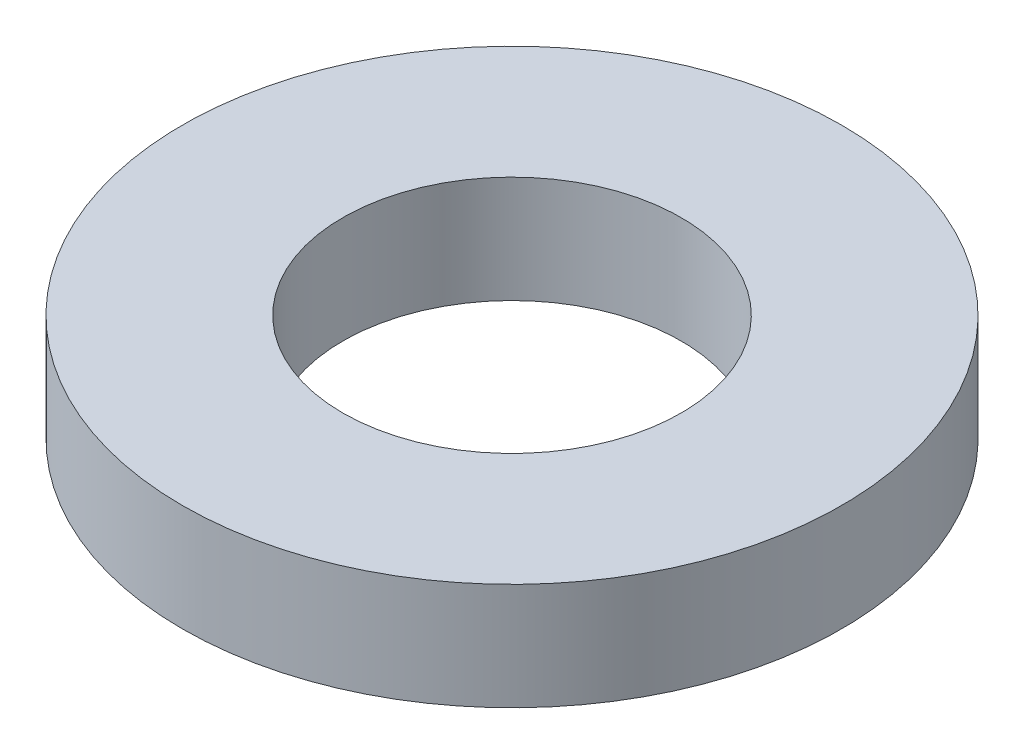
ISO-10303-21;
HEADER;
FILE_DESCRIPTION(('STEP AP214'),'2;1');
FILE_NAME('part.step','',(''),(''),'','','');
FILE_SCHEMA(('AUTOMOTIVE_DESIGN { 1 0 10303 214 1 1 1 1 }'));
ENDSEC;
DATA;
#1=APPLICATION_CONTEXT('core data for automotive mechanical design processes');
#2=APPLICATION_PROTOCOL_DEFINITION('international standard','automotive_design',2000,#1);
#3=PRODUCT_CONTEXT('',#1,'mechanical');
#4=PRODUCT('Part','Part','',(#3));
#5=PRODUCT_RELATED_PRODUCT_CATEGORY('part','',(#4));
#6=PRODUCT_DEFINITION_FORMATION('','',#4);
#7=PRODUCT_DEFINITION_CONTEXT('part definition',#1,'design');
#8=PRODUCT_DEFINITION('design','',#6,#7);
#9=PRODUCT_DEFINITION_SHAPE('','',#8);
#10=(LENGTH_UNIT() NAMED_UNIT(*) SI_UNIT(.MILLI.,.METRE.));
#11=(NAMED_UNIT(*) PLANE_ANGLE_UNIT() SI_UNIT($,.RADIAN.));
#12=(NAMED_UNIT(*) SI_UNIT($,.STERADIAN.) SOLID_ANGLE_UNIT());
#13=UNCERTAINTY_MEASURE_WITH_UNIT(LENGTH_MEASURE(1.E-05),#10,'distance_accuracy_value','');
#14=(GEOMETRIC_REPRESENTATION_CONTEXT(3) GLOBAL_UNCERTAINTY_ASSIGNED_CONTEXT((#13)) GLOBAL_UNIT_ASSIGNED_CONTEXT((#10,
#11,#12)) REPRESENTATION_CONTEXT('',''));
#15=CARTESIAN_POINT('',(0.,0.,0.));
#16=DIRECTION('',(0.,0.,1.));
#17=DIRECTION('',(1.,0.,0.));
#18=AXIS2_PLACEMENT_3D('',#15,#16,#17);
#19=CARTESIAN_POINT('',(0.,30.,0.));
#20=DIRECTION('',(0.,-1.,0.));
#21=DIRECTION('',(0.,0.,-1.));
#22=AXIS2_PLACEMENT_3D('',#19,#20,#21);
#23=CYLINDRICAL_SURFACE('',#22,92.5);
#24=CARTESIAN_POINT('',(0.,30.,0.));
#25=DIRECTION('',(0.,1.,0.));
#26=DIRECTION('',(0.,0.,1.));
#27=AXIS2_PLACEMENT_3D('',#24,#25,#26);
#28=CIRCLE('',#27,92.5);
#29=CARTESIAN_POINT('',(0.,30.,92.5));
#30=VERTEX_POINT('',#29);
#31=EDGE_CURVE('E10',#30,#30,#28,.T.);
#32=ORIENTED_EDGE('',*,*,#31,.F.);
#33=EDGE_LOOP('',(#32));
#34=FACE_BOUND('',#33,.T.);
#35=CARTESIAN_POINT('',(0.,0.,0.));
#36=DIRECTION('',(0.,1.,0.));
#37=DIRECTION('',(0.,0.,1.));
#38=AXIS2_PLACEMENT_3D('',#35,#36,#37);
#39=CIRCLE('',#38,92.5);
#40=CARTESIAN_POINT('',(0.,0.,92.5));
#41=VERTEX_POINT('',#40);
#42=EDGE_CURVE('E37',#41,#41,#39,.T.);
#43=ORIENTED_EDGE('',*,*,#42,.T.);
#44=EDGE_LOOP('',(#43));
#45=FACE_BOUND('',#44,.T.);
#46=ADVANCED_FACE('F40',(#34,#45),#23,.T.);
#47=CARTESIAN_POINT('',(0.,30.,0.));
#48=DIRECTION('',(0.,1.,0.));
#49=DIRECTION('',(0.,0.,1.));
#50=AXIS2_PLACEMENT_3D('',#47,#48,#49);
#51=PLANE('',#50);
#52=CARTESIAN_POINT('',(0.,30.,0.));
#53=DIRECTION('',(0.,1.,0.));
#54=DIRECTION('',(0.,0.,1.));
#55=AXIS2_PLACEMENT_3D('',#52,#53,#54);
#56=CIRCLE('',#55,47.5);
#57=CARTESIAN_POINT('',(0.,30.,47.5));
#58=VERTEX_POINT('',#57);
#59=EDGE_CURVE('E50',#58,#58,#56,.T.);
#60=ORIENTED_EDGE('',*,*,#59,.F.);
#61=EDGE_LOOP('',(#60));
#62=FACE_BOUND('',#61,.T.);
#63=ORIENTED_EDGE('',*,*,#31,.T.);
#64=EDGE_LOOP('',(#63));
#65=FACE_BOUND('',#64,.T.);
#66=ADVANCED_FACE('F59',(#62,#65),#51,.T.);
#67=CARTESIAN_POINT('',(0.,0.,0.));
#68=DIRECTION('',(0.,1.,0.));
#69=DIRECTION('',(0.,0.,1.));
#70=AXIS2_PLACEMENT_3D('',#67,#68,#69);
#71=PLANE('',#70);
#72=CARTESIAN_POINT('',(0.,0.,0.));
#73=DIRECTION('',(0.,1.,0.));
#74=DIRECTION('',(0.,0.,1.));
#75=AXIS2_PLACEMENT_3D('',#72,#73,#74);
#76=CIRCLE('',#75,47.5);
#77=CARTESIAN_POINT('',(0.,0.,47.5));
#78=VERTEX_POINT('',#77);
#79=EDGE_CURVE('E47',#78,#78,#76,.T.);
#80=ORIENTED_EDGE('',*,*,#79,.T.);
#81=EDGE_LOOP('',(#80));
#82=FACE_BOUND('',#81,.T.);
#83=ORIENTED_EDGE('',*,*,#42,.F.);
#84=EDGE_LOOP('',(#83));
#85=FACE_BOUND('',#84,.T.);
#86=ADVANCED_FACE('F58',(#82,#85),#71,.F.);
#87=CARTESIAN_POINT('',(0.,30.,0.));
#88=DIRECTION('',(0.,-1.,0.));
#89=DIRECTION('',(0.,0.,-1.));
#90=AXIS2_PLACEMENT_3D('',#87,#88,#89);
#91=CYLINDRICAL_SURFACE('',#90,47.5);
#92=ORIENTED_EDGE('',*,*,#59,.T.);
#93=EDGE_LOOP('',(#92));
#94=FACE_BOUND('',#93,.T.);
#95=ORIENTED_EDGE('',*,*,#79,.F.);
#96=EDGE_LOOP('',(#95));
#97=FACE_BOUND('',#96,.T.);
#98=ADVANCED_FACE('F54',(#94,#97),#91,.F.);
#99=CLOSED_SHELL('',(#46,#66,#86,#98));
#100=MANIFOLD_SOLID_BREP('B2',#99);
#101=ADVANCED_BREP_SHAPE_REPRESENTATION('',(#18,#100),#14);
#102=SHAPE_DEFINITION_REPRESENTATION(#9,#101);
ENDSEC;
END-ISO-10303-21;
